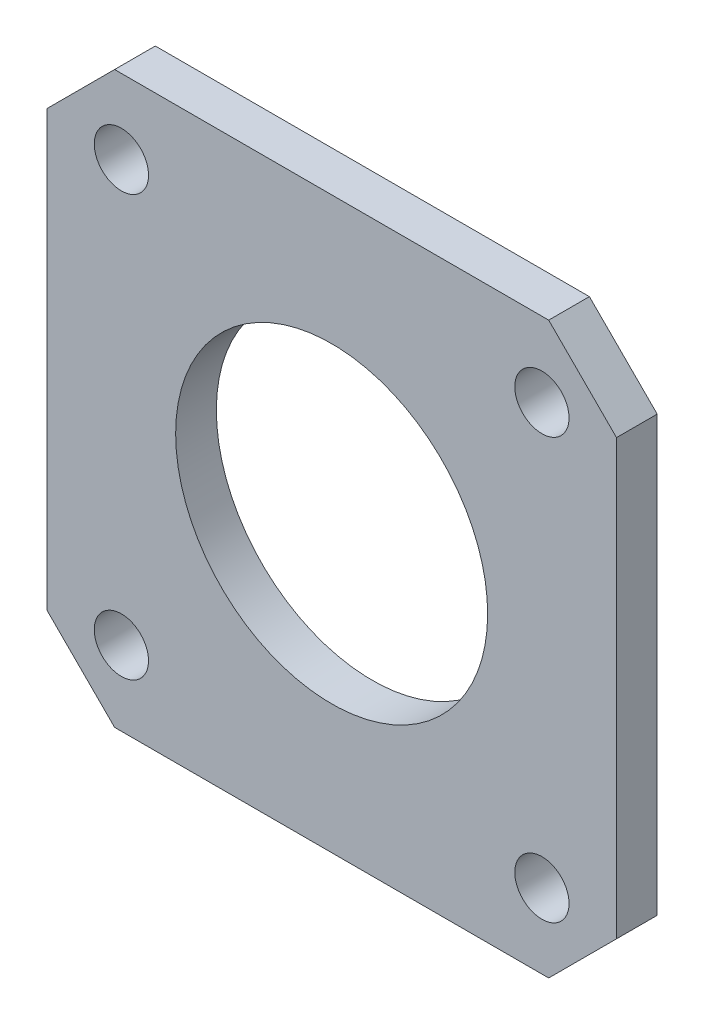
ISO-10303-21;
HEADER;
FILE_DESCRIPTION(('STEP AP214'),'2;1');
FILE_NAME('part.step','',(''),(''),'','','');
FILE_SCHEMA(('AUTOMOTIVE_DESIGN { 1 0 10303 214 1 1 1 1 }'));
ENDSEC;
DATA;
#1=APPLICATION_CONTEXT('core data for automotive mechanical design processes');
#2=APPLICATION_PROTOCOL_DEFINITION('international standard','automotive_design',2000,#1);
#3=PRODUCT_CONTEXT('',#1,'mechanical');
#4=PRODUCT('Part','Part','',(#3));
#5=PRODUCT_RELATED_PRODUCT_CATEGORY('part','',(#4));
#6=PRODUCT_DEFINITION_FORMATION('','',#4);
#7=PRODUCT_DEFINITION_CONTEXT('part definition',#1,'design');
#8=PRODUCT_DEFINITION('design','',#6,#7);
#9=PRODUCT_DEFINITION_SHAPE('','',#8);
#10=(LENGTH_UNIT() NAMED_UNIT(*) SI_UNIT(.MILLI.,.METRE.));
#11=(NAMED_UNIT(*) PLANE_ANGLE_UNIT() SI_UNIT($,.RADIAN.));
#12=(NAMED_UNIT(*) SI_UNIT($,.STERADIAN.) SOLID_ANGLE_UNIT());
#13=UNCERTAINTY_MEASURE_WITH_UNIT(LENGTH_MEASURE(1.E-05),#10,'distance_accuracy_value','');
#14=(GEOMETRIC_REPRESENTATION_CONTEXT(3) GLOBAL_UNCERTAINTY_ASSIGNED_CONTEXT((#13)) GLOBAL_UNIT_ASSIGNED_CONTEXT((#10,
#11,#12)) REPRESENTATION_CONTEXT('',''));
#15=CARTESIAN_POINT('',(0.,0.,0.));
#16=DIRECTION('',(0.,0.,1.));
#17=DIRECTION('',(1.,0.,0.));
#18=AXIS2_PLACEMENT_3D('',#15,#16,#17);
#19=CARTESIAN_POINT('',(0.,37.,-3.));
#20=DIRECTION('',(-0.707106781186547,0.707106781186548,0.));
#21=DIRECTION('',(-0.707106781186548,-0.707106781186547,0.));
#22=AXIS2_PLACEMENT_3D('',#19,#20,#21);
#23=PLANE('',#22);
#24=DIRECTION('',(-0.707106781186548,-0.707106781186547,0.));
#25=VECTOR('',#24,1.);
#26=CARTESIAN_POINT('',(0.,37.,0.));
#27=LINE('',#26,#25);
#28=CARTESIAN_POINT('',(5.,42.,0.));
#29=VERTEX_POINT('',#28);
#30=CARTESIAN_POINT('',(0.,37.,0.));
#31=VERTEX_POINT('',#30);
#32=EDGE_CURVE('E130',#29,#31,#27,.T.);
#33=ORIENTED_EDGE('',*,*,#32,.F.);
#34=DIRECTION('',(0.,0.,1.));
#35=VECTOR('',#34,1.);
#36=CARTESIAN_POINT('',(5.,42.,-3.));
#37=LINE('',#36,#35);
#38=CARTESIAN_POINT('',(5.,42.,-3.));
#39=VERTEX_POINT('',#38);
#40=EDGE_CURVE('E11',#39,#29,#37,.T.);
#41=ORIENTED_EDGE('',*,*,#40,.F.);
#42=DIRECTION('',(-0.707106781186548,-0.707106781186547,0.));
#43=VECTOR('',#42,1.);
#44=CARTESIAN_POINT('',(0.,37.,-3.));
#45=LINE('',#44,#43);
#46=CARTESIAN_POINT('',(0.,37.,-3.));
#47=VERTEX_POINT('',#46);
#48=EDGE_CURVE('E151',#39,#47,#45,.T.);
#49=ORIENTED_EDGE('',*,*,#48,.T.);
#50=DIRECTION('',(0.,0.,1.));
#51=VECTOR('',#50,1.);
#52=CARTESIAN_POINT('',(0.,37.,-3.));
#53=LINE('',#52,#51);
#54=EDGE_CURVE('E36',#47,#31,#53,.T.);
#55=ORIENTED_EDGE('',*,*,#54,.T.);
#56=EDGE_LOOP('',(#33,#41,#49,#55));
#57=FACE_BOUND('',#56,.T.);
#58=ADVANCED_FACE('F33',(#57),#23,.T.);
#59=CARTESIAN_POINT('',(5.,42.,-3.));
#60=DIRECTION('',(0.,1.,0.));
#61=DIRECTION('',(0.,0.,1.));
#62=AXIS2_PLACEMENT_3D('',#59,#60,#61);
#63=PLANE('',#62);
#64=DIRECTION('',(-1.,0.,0.));
#65=VECTOR('',#64,1.);
#66=CARTESIAN_POINT('',(5.,42.,0.));
#67=LINE('',#66,#65);
#68=CARTESIAN_POINT('',(37.,42.,0.));
#69=VERTEX_POINT('',#68);
#70=EDGE_CURVE('E149',#69,#29,#67,.T.);
#71=ORIENTED_EDGE('',*,*,#70,.F.);
#72=DIRECTION('',(0.,0.,1.));
#73=VECTOR('',#72,1.);
#74=CARTESIAN_POINT('',(37.,42.,-3.));
#75=LINE('',#74,#73);
#76=CARTESIAN_POINT('',(37.,42.,-3.));
#77=VERTEX_POINT('',#76);
#78=EDGE_CURVE('E42',#77,#69,#75,.T.);
#79=ORIENTED_EDGE('',*,*,#78,.F.);
#80=DIRECTION('',(-1.,0.,0.));
#81=VECTOR('',#80,1.);
#82=CARTESIAN_POINT('',(5.,42.,-3.));
#83=LINE('',#82,#81);
#84=EDGE_CURVE('E120',#77,#39,#83,.T.);
#85=ORIENTED_EDGE('',*,*,#84,.T.);
#86=ORIENTED_EDGE('',*,*,#40,.T.);
#87=EDGE_LOOP('',(#71,#79,#85,#86));
#88=FACE_BOUND('',#87,.T.);
#89=ADVANCED_FACE('F163',(#88),#63,.T.);
#90=CARTESIAN_POINT('',(42.,37.,-3.));
#91=DIRECTION('',(0.707106781186548,0.707106781186548,0.));
#92=DIRECTION('',(-0.707106781186548,0.707106781186548,0.));
#93=AXIS2_PLACEMENT_3D('',#90,#91,#92);
#94=PLANE('',#93);
#95=DIRECTION('',(-0.707106781186547,0.707106781186547,0.));
#96=VECTOR('',#95,1.);
#97=CARTESIAN_POINT('',(42.,37.,0.));
#98=LINE('',#97,#96);
#99=CARTESIAN_POINT('',(42.,37.,0.));
#100=VERTEX_POINT('',#99);
#101=EDGE_CURVE('E107',#100,#69,#98,.T.);
#102=ORIENTED_EDGE('',*,*,#101,.F.);
#103=DIRECTION('',(0.,0.,1.));
#104=VECTOR('',#103,1.);
#105=CARTESIAN_POINT('',(42.,37.,-3.));
#106=LINE('',#105,#104);
#107=CARTESIAN_POINT('',(42.,37.,-3.));
#108=VERTEX_POINT('',#107);
#109=EDGE_CURVE('E102',#108,#100,#106,.T.);
#110=ORIENTED_EDGE('',*,*,#109,.F.);
#111=DIRECTION('',(-0.707106781186547,0.707106781186547,0.));
#112=VECTOR('',#111,1.);
#113=CARTESIAN_POINT('',(42.,37.,-3.));
#114=LINE('',#113,#112);
#115=EDGE_CURVE('E105',#108,#77,#114,.T.);
#116=ORIENTED_EDGE('',*,*,#115,.T.);
#117=ORIENTED_EDGE('',*,*,#78,.T.);
#118=EDGE_LOOP('',(#102,#110,#116,#117));
#119=FACE_BOUND('',#118,.T.);
#120=ADVANCED_FACE('F104',(#119),#94,.T.);
#121=CARTESIAN_POINT('',(42.,5.,-3.));
#122=DIRECTION('',(1.,0.,0.));
#123=DIRECTION('',(0.,0.,-1.));
#124=AXIS2_PLACEMENT_3D('',#121,#122,#123);
#125=PLANE('',#124);
#126=DIRECTION('',(0.,1.,0.));
#127=VECTOR('',#126,1.);
#128=CARTESIAN_POINT('',(42.,5.,0.));
#129=LINE('',#128,#127);
#130=CARTESIAN_POINT('',(42.,5.,0.));
#131=VERTEX_POINT('',#130);
#132=EDGE_CURVE('E146',#131,#100,#129,.T.);
#133=ORIENTED_EDGE('',*,*,#132,.F.);
#134=DIRECTION('',(0.,0.,1.));
#135=VECTOR('',#134,1.);
#136=CARTESIAN_POINT('',(42.,5.,-3.));
#137=LINE('',#136,#135);
#138=CARTESIAN_POINT('',(42.,5.,-3.));
#139=VERTEX_POINT('',#138);
#140=EDGE_CURVE('E112',#139,#131,#137,.T.);
#141=ORIENTED_EDGE('',*,*,#140,.F.);
#142=DIRECTION('',(0.,1.,0.));
#143=VECTOR('',#142,1.);
#144=CARTESIAN_POINT('',(42.,5.,-3.));
#145=LINE('',#144,#143);
#146=EDGE_CURVE('E118',#139,#108,#145,.T.);
#147=ORIENTED_EDGE('',*,*,#146,.T.);
#148=ORIENTED_EDGE('',*,*,#109,.T.);
#149=EDGE_LOOP('',(#133,#141,#147,#148));
#150=FACE_BOUND('',#149,.T.);
#151=ADVANCED_FACE('F122',(#150),#125,.T.);
#152=CARTESIAN_POINT('',(37.,0.,-3.));
#153=DIRECTION('',(0.707106781186548,-0.707106781186547,0.));
#154=DIRECTION('',(0.707106781186547,0.707106781186548,0.));
#155=AXIS2_PLACEMENT_3D('',#152,#153,#154);
#156=PLANE('',#155);
#157=DIRECTION('',(0.707106781186547,0.707106781186548,0.));
#158=VECTOR('',#157,1.);
#159=CARTESIAN_POINT('',(37.,0.,0.));
#160=LINE('',#159,#158);
#161=CARTESIAN_POINT('',(37.,0.,0.));
#162=VERTEX_POINT('',#161);
#163=EDGE_CURVE('E143',#162,#131,#160,.T.);
#164=ORIENTED_EDGE('',*,*,#163,.F.);
#165=DIRECTION('',(0.,0.,1.));
#166=VECTOR('',#165,1.);
#167=CARTESIAN_POINT('',(37.,0.,-3.));
#168=LINE('',#167,#166);
#169=CARTESIAN_POINT('',(37.,0.,-3.));
#170=VERTEX_POINT('',#169);
#171=EDGE_CURVE('E155',#170,#162,#168,.T.);
#172=ORIENTED_EDGE('',*,*,#171,.F.);
#173=DIRECTION('',(0.707106781186547,0.707106781186548,0.));
#174=VECTOR('',#173,1.);
#175=CARTESIAN_POINT('',(37.,0.,-3.));
#176=LINE('',#175,#174);
#177=EDGE_CURVE('E123',#170,#139,#176,.T.);
#178=ORIENTED_EDGE('',*,*,#177,.T.);
#179=ORIENTED_EDGE('',*,*,#140,.T.);
#180=EDGE_LOOP('',(#164,#172,#178,#179));
#181=FACE_BOUND('',#180,.T.);
#182=ADVANCED_FACE('F176',(#181),#156,.T.);
#183=CARTESIAN_POINT('',(5.,0.,-3.));
#184=DIRECTION('',(0.,-1.,0.));
#185=DIRECTION('',(0.,0.,-1.));
#186=AXIS2_PLACEMENT_3D('',#183,#184,#185);
#187=PLANE('',#186);
#188=DIRECTION('',(1.,0.,0.));
#189=VECTOR('',#188,1.);
#190=CARTESIAN_POINT('',(5.,0.,0.));
#191=LINE('',#190,#189);
#192=CARTESIAN_POINT('',(5.,0.,0.));
#193=VERTEX_POINT('',#192);
#194=EDGE_CURVE('E140',#193,#162,#191,.T.);
#195=ORIENTED_EDGE('',*,*,#194,.F.);
#196=DIRECTION('',(0.,0.,1.));
#197=VECTOR('',#196,1.);
#198=CARTESIAN_POINT('',(5.,0.,-3.));
#199=LINE('',#198,#197);
#200=CARTESIAN_POINT('',(5.,0.,-3.));
#201=VERTEX_POINT('',#200);
#202=EDGE_CURVE('E157',#201,#193,#199,.T.);
#203=ORIENTED_EDGE('',*,*,#202,.F.);
#204=DIRECTION('',(1.,0.,0.));
#205=VECTOR('',#204,1.);
#206=CARTESIAN_POINT('',(5.,0.,-3.));
#207=LINE('',#206,#205);
#208=EDGE_CURVE('E125',#201,#170,#207,.T.);
#209=ORIENTED_EDGE('',*,*,#208,.T.);
#210=ORIENTED_EDGE('',*,*,#171,.T.);
#211=EDGE_LOOP('',(#195,#203,#209,#210));
#212=FACE_BOUND('',#211,.T.);
#213=ADVANCED_FACE('F179',(#212),#187,.T.);
#214=CARTESIAN_POINT('',(5.,0.,-3.));
#215=DIRECTION('',(-0.707106781186548,-0.707106781186547,0.));
#216=DIRECTION('',(0.707106781186547,-0.707106781186548,0.));
#217=AXIS2_PLACEMENT_3D('',#214,#215,#216);
#218=PLANE('',#217);
#219=DIRECTION('',(0.707106781186547,-0.707106781186548,0.));
#220=VECTOR('',#219,1.);
#221=CARTESIAN_POINT('',(5.,0.,0.));
#222=LINE('',#221,#220);
#223=CARTESIAN_POINT('',(0.,5.,0.));
#224=VERTEX_POINT('',#223);
#225=EDGE_CURVE('E137',#224,#193,#222,.T.);
#226=ORIENTED_EDGE('',*,*,#225,.F.);
#227=DIRECTION('',(0.,0.,1.));
#228=VECTOR('',#227,1.);
#229=CARTESIAN_POINT('',(0.,5.,-3.));
#230=LINE('',#229,#228);
#231=CARTESIAN_POINT('',(0.,5.,-3.));
#232=VERTEX_POINT('',#231);
#233=EDGE_CURVE('E158',#232,#224,#230,.T.);
#234=ORIENTED_EDGE('',*,*,#233,.F.);
#235=DIRECTION('',(0.707106781186547,-0.707106781186548,0.));
#236=VECTOR('',#235,1.);
#237=CARTESIAN_POINT('',(5.,0.,-3.));
#238=LINE('',#237,#236);
#239=EDGE_CURVE('E255',#232,#201,#238,.T.);
#240=ORIENTED_EDGE('',*,*,#239,.T.);
#241=ORIENTED_EDGE('',*,*,#202,.T.);
#242=EDGE_LOOP('',(#226,#234,#240,#241));
#243=FACE_BOUND('',#242,.T.);
#244=ADVANCED_FACE('F183',(#243),#218,.T.);
#245=CARTESIAN_POINT('',(0.,5.,-3.));
#246=DIRECTION('',(-1.,0.,0.));
#247=DIRECTION('',(0.,0.,1.));
#248=AXIS2_PLACEMENT_3D('',#245,#246,#247);
#249=PLANE('',#248);
#250=DIRECTION('',(0.,-1.,0.));
#251=VECTOR('',#250,1.);
#252=CARTESIAN_POINT('',(0.,5.,0.));
#253=LINE('',#252,#251);
#254=EDGE_CURVE('E133',#31,#224,#253,.T.);
#255=ORIENTED_EDGE('',*,*,#254,.F.);
#256=ORIENTED_EDGE('',*,*,#54,.F.);
#257=DIRECTION('',(0.,-1.,0.));
#258=VECTOR('',#257,1.);
#259=CARTESIAN_POINT('',(0.,5.,-3.));
#260=LINE('',#259,#258);
#261=EDGE_CURVE('E253',#47,#232,#260,.T.);
#262=ORIENTED_EDGE('',*,*,#261,.T.);
#263=ORIENTED_EDGE('',*,*,#233,.T.);
#264=EDGE_LOOP('',(#255,#256,#262,#263));
#265=FACE_BOUND('',#264,.T.);
#266=ADVANCED_FACE('F160',(#265),#249,.T.);
#267=CARTESIAN_POINT('',(0.,0.,-3.));
#268=DIRECTION('',(0.,0.,1.));
#269=DIRECTION('',(1.,0.,0.));
#270=AXIS2_PLACEMENT_3D('',#267,#268,#269);
#271=PLANE('',#270);
#272=CARTESIAN_POINT('',(36.5,36.5,-3.));
#273=DIRECTION('',(0.,0.,1.));
#274=DIRECTION('',(-1.,0.,0.));
#275=AXIS2_PLACEMENT_3D('',#272,#273,#274);
#276=CIRCLE('',#275,2.);
#277=CARTESIAN_POINT('',(34.5,36.5,-3.));
#278=VERTEX_POINT('',#277);
#279=EDGE_CURVE('E222',#278,#278,#276,.T.);
#280=ORIENTED_EDGE('',*,*,#279,.T.);
#281=EDGE_LOOP('',(#280));
#282=FACE_BOUND('',#281,.T.);
#283=CARTESIAN_POINT('',(36.5,5.49999999999999,-3.));
#284=DIRECTION('',(0.,0.,1.));
#285=DIRECTION('',(1.,0.,0.));
#286=AXIS2_PLACEMENT_3D('',#283,#284,#285);
#287=CIRCLE('',#286,2.);
#288=CARTESIAN_POINT('',(38.5,5.49999999999999,-3.));
#289=VERTEX_POINT('',#288);
#290=EDGE_CURVE('E230',#289,#289,#287,.T.);
#291=ORIENTED_EDGE('',*,*,#290,.T.);
#292=EDGE_LOOP('',(#291));
#293=FACE_BOUND('',#292,.T.);
#294=CARTESIAN_POINT('',(5.5,5.5,-3.));
#295=DIRECTION('',(0.,0.,1.));
#296=DIRECTION('',(-1.,0.,0.));
#297=AXIS2_PLACEMENT_3D('',#294,#295,#296);
#298=CIRCLE('',#297,2.);
#299=CARTESIAN_POINT('',(3.5,5.5,-3.));
#300=VERTEX_POINT('',#299);
#301=EDGE_CURVE('E236',#300,#300,#298,.T.);
#302=ORIENTED_EDGE('',*,*,#301,.T.);
#303=EDGE_LOOP('',(#302));
#304=FACE_BOUND('',#303,.T.);
#305=CARTESIAN_POINT('',(5.5,36.5,-3.));
#306=DIRECTION('',(0.,0.,1.));
#307=DIRECTION('',(1.,0.,0.));
#308=AXIS2_PLACEMENT_3D('',#305,#306,#307);
#309=CIRCLE('',#308,2.);
#310=CARTESIAN_POINT('',(7.5,36.5,-3.));
#311=VERTEX_POINT('',#310);
#312=EDGE_CURVE('E242',#311,#311,#309,.T.);
#313=ORIENTED_EDGE('',*,*,#312,.T.);
#314=EDGE_LOOP('',(#313));
#315=FACE_BOUND('',#314,.T.);
#316=CARTESIAN_POINT('',(21.,21.,-3.));
#317=DIRECTION('',(0.,0.,1.));
#318=DIRECTION('',(1.,0.,0.));
#319=AXIS2_PLACEMENT_3D('',#316,#317,#318);
#320=CIRCLE('',#319,11.5);
#321=CARTESIAN_POINT('',(32.5,21.,-3.));
#322=VERTEX_POINT('',#321);
#323=EDGE_CURVE('E134',#322,#322,#320,.T.);
#324=ORIENTED_EDGE('',*,*,#323,.T.);
#325=EDGE_LOOP('',(#324));
#326=FACE_BOUND('',#325,.T.);
#327=ORIENTED_EDGE('',*,*,#48,.F.);
#328=ORIENTED_EDGE('',*,*,#84,.F.);
#329=ORIENTED_EDGE('',*,*,#115,.F.);
#330=ORIENTED_EDGE('',*,*,#146,.F.);
#331=ORIENTED_EDGE('',*,*,#177,.F.);
#332=ORIENTED_EDGE('',*,*,#208,.F.);
#333=ORIENTED_EDGE('',*,*,#239,.F.);
#334=ORIENTED_EDGE('',*,*,#261,.F.);
#335=EDGE_LOOP('',(#327,#328,#329,#330,#331,#332,#333,#334));
#336=FACE_BOUND('',#335,.T.);
#337=ADVANCED_FACE('F116',(#282,#293,#304,#315,#326,#336),#271,.F.);
#338=CARTESIAN_POINT('',(0.,0.,0.));
#339=DIRECTION('',(0.,0.,1.));
#340=DIRECTION('',(1.,0.,0.));
#341=AXIS2_PLACEMENT_3D('',#338,#339,#340);
#342=PLANE('',#341);
#343=CARTESIAN_POINT('',(36.5,36.5,0.));
#344=DIRECTION('',(0.,0.,1.));
#345=DIRECTION('',(-1.,0.,0.));
#346=AXIS2_PLACEMENT_3D('',#343,#344,#345);
#347=CIRCLE('',#346,2.);
#348=CARTESIAN_POINT('',(34.5,36.5,0.));
#349=VERTEX_POINT('',#348);
#350=EDGE_CURVE('E225',#349,#349,#347,.T.);
#351=ORIENTED_EDGE('',*,*,#350,.F.);
#352=EDGE_LOOP('',(#351));
#353=FACE_BOUND('',#352,.T.);
#354=CARTESIAN_POINT('',(36.5,5.49999999999999,0.));
#355=DIRECTION('',(0.,0.,1.));
#356=DIRECTION('',(1.,0.,0.));
#357=AXIS2_PLACEMENT_3D('',#354,#355,#356);
#358=CIRCLE('',#357,2.);
#359=CARTESIAN_POINT('',(38.5,5.49999999999999,0.));
#360=VERTEX_POINT('',#359);
#361=EDGE_CURVE('E227',#360,#360,#358,.T.);
#362=ORIENTED_EDGE('',*,*,#361,.F.);
#363=EDGE_LOOP('',(#362));
#364=FACE_BOUND('',#363,.T.);
#365=CARTESIAN_POINT('',(5.5,5.5,0.));
#366=DIRECTION('',(0.,0.,1.));
#367=DIRECTION('',(-1.,0.,0.));
#368=AXIS2_PLACEMENT_3D('',#365,#366,#367);
#369=CIRCLE('',#368,2.);
#370=CARTESIAN_POINT('',(3.5,5.5,0.));
#371=VERTEX_POINT('',#370);
#372=EDGE_CURVE('E233',#371,#371,#369,.T.);
#373=ORIENTED_EDGE('',*,*,#372,.F.);
#374=EDGE_LOOP('',(#373));
#375=FACE_BOUND('',#374,.T.);
#376=CARTESIAN_POINT('',(5.5,36.5,0.));
#377=DIRECTION('',(0.,0.,1.));
#378=DIRECTION('',(1.,0.,0.));
#379=AXIS2_PLACEMENT_3D('',#376,#377,#378);
#380=CIRCLE('',#379,2.);
#381=CARTESIAN_POINT('',(7.5,36.5,0.));
#382=VERTEX_POINT('',#381);
#383=EDGE_CURVE('E239',#382,#382,#380,.T.);
#384=ORIENTED_EDGE('',*,*,#383,.F.);
#385=EDGE_LOOP('',(#384));
#386=FACE_BOUND('',#385,.T.);
#387=CARTESIAN_POINT('',(21.,21.,0.));
#388=DIRECTION('',(0.,0.,1.));
#389=DIRECTION('',(1.,0.,0.));
#390=AXIS2_PLACEMENT_3D('',#387,#388,#389);
#391=CIRCLE('',#390,11.5);
#392=CARTESIAN_POINT('',(32.5,21.,0.));
#393=VERTEX_POINT('',#392);
#394=EDGE_CURVE('E245',#393,#393,#391,.T.);
#395=ORIENTED_EDGE('',*,*,#394,.F.);
#396=EDGE_LOOP('',(#395));
#397=FACE_BOUND('',#396,.T.);
#398=ORIENTED_EDGE('',*,*,#32,.T.);
#399=ORIENTED_EDGE('',*,*,#254,.T.);
#400=ORIENTED_EDGE('',*,*,#225,.T.);
#401=ORIENTED_EDGE('',*,*,#194,.T.);
#402=ORIENTED_EDGE('',*,*,#163,.T.);
#403=ORIENTED_EDGE('',*,*,#132,.T.);
#404=ORIENTED_EDGE('',*,*,#101,.T.);
#405=ORIENTED_EDGE('',*,*,#70,.T.);
#406=EDGE_LOOP('',(#398,#399,#400,#401,#402,#403,#404,#405));
#407=FACE_BOUND('',#406,.T.);
#408=ADVANCED_FACE('F162',(#353,#364,#375,#386,#397,#407),#342,.T.);
#409=CARTESIAN_POINT('',(21.,21.,-3.));
#410=DIRECTION('',(0.,0.,1.));
#411=DIRECTION('',(1.,0.,0.));
#412=AXIS2_PLACEMENT_3D('',#409,#410,#411);
#413=CYLINDRICAL_SURFACE('',#412,11.5);
#414=ORIENTED_EDGE('',*,*,#323,.F.);
#415=EDGE_LOOP('',(#414));
#416=FACE_BOUND('',#415,.T.);
#417=ORIENTED_EDGE('',*,*,#394,.T.);
#418=EDGE_LOOP('',(#417));
#419=FACE_BOUND('',#418,.T.);
#420=ADVANCED_FACE('F195',(#416,#419),#413,.F.);
#421=CARTESIAN_POINT('',(5.5,36.5,-3.));
#422=DIRECTION('',(0.,0.,1.));
#423=DIRECTION('',(1.,0.,0.));
#424=AXIS2_PLACEMENT_3D('',#421,#422,#423);
#425=CYLINDRICAL_SURFACE('',#424,2.);
#426=ORIENTED_EDGE('',*,*,#312,.F.);
#427=EDGE_LOOP('',(#426));
#428=FACE_BOUND('',#427,.T.);
#429=ORIENTED_EDGE('',*,*,#383,.T.);
#430=EDGE_LOOP('',(#429));
#431=FACE_BOUND('',#430,.T.);
#432=ADVANCED_FACE('F202',(#428,#431),#425,.F.);
#433=CARTESIAN_POINT('',(5.5,5.5,-3.));
#434=DIRECTION('',(0.,0.,1.));
#435=DIRECTION('',(1.,0.,0.));
#436=AXIS2_PLACEMENT_3D('',#433,#434,#435);
#437=CYLINDRICAL_SURFACE('',#436,2.);
#438=ORIENTED_EDGE('',*,*,#301,.F.);
#439=EDGE_LOOP('',(#438));
#440=FACE_BOUND('',#439,.T.);
#441=ORIENTED_EDGE('',*,*,#372,.T.);
#442=EDGE_LOOP('',(#441));
#443=FACE_BOUND('',#442,.T.);
#444=ADVANCED_FACE('F206',(#440,#443),#437,.F.);
#445=CARTESIAN_POINT('',(36.5,5.49999999999999,-3.));
#446=DIRECTION('',(0.,0.,1.));
#447=DIRECTION('',(1.,0.,0.));
#448=AXIS2_PLACEMENT_3D('',#445,#446,#447);
#449=CYLINDRICAL_SURFACE('',#448,2.);
#450=ORIENTED_EDGE('',*,*,#290,.F.);
#451=EDGE_LOOP('',(#450));
#452=FACE_BOUND('',#451,.T.);
#453=ORIENTED_EDGE('',*,*,#361,.T.);
#454=EDGE_LOOP('',(#453));
#455=FACE_BOUND('',#454,.T.);
#456=ADVANCED_FACE('F210',(#452,#455),#449,.F.);
#457=CARTESIAN_POINT('',(36.5,36.5,-3.));
#458=DIRECTION('',(0.,0.,1.));
#459=DIRECTION('',(1.,0.,0.));
#460=AXIS2_PLACEMENT_3D('',#457,#458,#459);
#461=CYLINDRICAL_SURFACE('',#460,2.);
#462=ORIENTED_EDGE('',*,*,#279,.F.);
#463=EDGE_LOOP('',(#462));
#464=FACE_BOUND('',#463,.T.);
#465=ORIENTED_EDGE('',*,*,#350,.T.);
#466=EDGE_LOOP('',(#465));
#467=FACE_BOUND('',#466,.T.);
#468=ADVANCED_FACE('F214',(#464,#467),#461,.F.);
#469=CLOSED_SHELL('',(#58,#89,#120,#151,#182,#213,#244,#266,#337,#408,#420,#432,#444,#456,#468));
#470=MANIFOLD_SOLID_BREP('B2',#469);
#471=ADVANCED_BREP_SHAPE_REPRESENTATION('',(#18,#470),#14);
#472=SHAPE_DEFINITION_REPRESENTATION(#9,#471);
ENDSEC;
END-ISO-10303-21;
